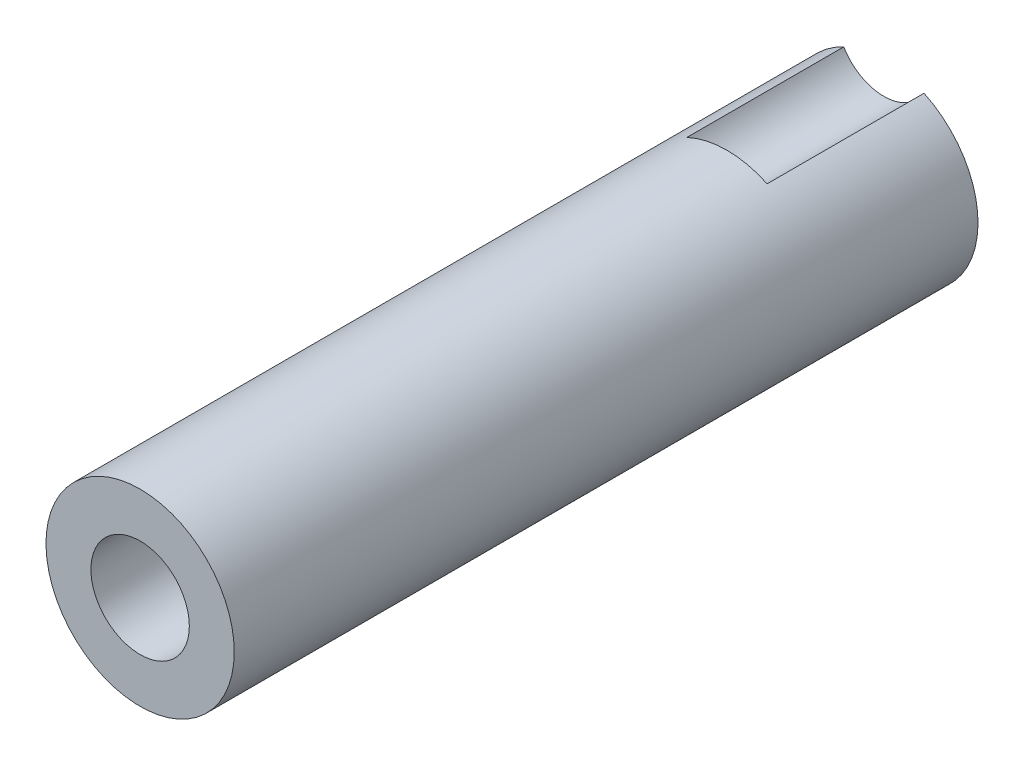
ISO-10303-21;
HEADER;
FILE_DESCRIPTION(('STEP AP214'),'2;1');
FILE_NAME('part.step','',(''),(''),'','','');
FILE_SCHEMA(('AUTOMOTIVE_DESIGN { 1 0 10303 214 1 1 1 1 }'));
ENDSEC;
DATA;
#1=APPLICATION_CONTEXT('core data for automotive mechanical design processes');
#2=APPLICATION_PROTOCOL_DEFINITION('international standard','automotive_design',2000,#1);
#3=PRODUCT_CONTEXT('',#1,'mechanical');
#4=PRODUCT('Part','Part','',(#3));
#5=PRODUCT_RELATED_PRODUCT_CATEGORY('part','',(#4));
#6=PRODUCT_DEFINITION_FORMATION('','',#4);
#7=PRODUCT_DEFINITION_CONTEXT('part definition',#1,'design');
#8=PRODUCT_DEFINITION('design','',#6,#7);
#9=PRODUCT_DEFINITION_SHAPE('','',#8);
#10=(LENGTH_UNIT() NAMED_UNIT(*) SI_UNIT(.MILLI.,.METRE.));
#11=(NAMED_UNIT(*) PLANE_ANGLE_UNIT() SI_UNIT($,.RADIAN.));
#12=(NAMED_UNIT(*) SI_UNIT($,.STERADIAN.) SOLID_ANGLE_UNIT());
#13=UNCERTAINTY_MEASURE_WITH_UNIT(LENGTH_MEASURE(1.E-05),#10,'distance_accuracy_value','');
#14=(GEOMETRIC_REPRESENTATION_CONTEXT(3) GLOBAL_UNCERTAINTY_ASSIGNED_CONTEXT((#13)) GLOBAL_UNIT_ASSIGNED_CONTEXT((#10,
#11,#12)) REPRESENTATION_CONTEXT('',''));
#15=CARTESIAN_POINT('',(0.,0.,0.));
#16=DIRECTION('',(0.,0.,1.));
#17=DIRECTION('',(1.,0.,0.));
#18=AXIS2_PLACEMENT_3D('',#15,#16,#17);
#19=CARTESIAN_POINT('',(0.,0.,50.5714));
#20=DIRECTION('',(0.,0.,-1.));
#21=DIRECTION('',(-1.,0.,0.));
#22=AXIS2_PLACEMENT_3D('',#19,#20,#21);
#23=CYLINDRICAL_SURFACE('',#22,6.4008);
#24=DIRECTION('',(0.,0.,-1.));
#25=VECTOR('',#24,1.);
#26=CARTESIAN_POINT('',(-2.72999636791962,5.78941797343616,5.334));
#27=LINE('',#26,#25);
#28=CARTESIAN_POINT('',(-2.72999636791962,5.78941797343616,10.668));
#29=VERTEX_POINT('',#28);
#30=CARTESIAN_POINT('',(-2.72999636791962,5.78941797343616,0.));
#31=VERTEX_POINT('',#30);
#32=EDGE_CURVE('E44',#29,#31,#27,.T.);
#33=ORIENTED_EDGE('',*,*,#32,.T.);
#34=CARTESIAN_POINT('',(0.,0.,0.));
#35=DIRECTION('',(0.,0.,-1.));
#36=DIRECTION('',(-1.,0.,0.));
#37=AXIS2_PLACEMENT_3D('',#34,#35,#36);
#38=CIRCLE('',#37,6.4008);
#39=CARTESIAN_POINT('',(2.72999636791962,5.78941797343616,0.));
#40=VERTEX_POINT('',#39);
#41=EDGE_CURVE('E65',#40,#31,#38,.T.);
#42=ORIENTED_EDGE('',*,*,#41,.F.);
#43=DIRECTION('',(0.,0.,-1.));
#44=VECTOR('',#43,1.);
#45=CARTESIAN_POINT('',(2.72999636791962,5.78941797343616,5.334));
#46=LINE('',#45,#44);
#47=CARTESIAN_POINT('',(2.72999636791962,5.78941797343616,10.668));
#48=VERTEX_POINT('',#47);
#49=EDGE_CURVE('E11',#40,#48,#46,.F.);
#50=ORIENTED_EDGE('',*,*,#49,.T.);
#51=CARTESIAN_POINT('',(0.,0.,10.668));
#52=DIRECTION('',(0.,0.,-1.));
#53=DIRECTION('',(-1.,0.,0.));
#54=AXIS2_PLACEMENT_3D('',#51,#52,#53);
#55=CIRCLE('',#54,6.4008);
#56=EDGE_CURVE('E67',#29,#48,#55,.T.);
#57=ORIENTED_EDGE('',*,*,#56,.F.);
#58=EDGE_LOOP('',(#33,#42,#50,#57));
#59=FACE_BOUND('',#58,.T.);
#60=CARTESIAN_POINT('',(0.,0.,50.5714));
#61=DIRECTION('',(0.,0.,1.));
#62=DIRECTION('',(1.,0.,0.));
#63=AXIS2_PLACEMENT_3D('',#60,#61,#62);
#64=CIRCLE('',#63,6.4008);
#65=CARTESIAN_POINT('',(6.4008,0.,50.5714));
#66=VERTEX_POINT('',#65);
#67=EDGE_CURVE('E77',#66,#66,#64,.T.);
#68=ORIENTED_EDGE('',*,*,#67,.F.);
#69=EDGE_LOOP('',(#68));
#70=FACE_BOUND('',#69,.T.);
#71=CARTESIAN_POINT('',(0.,-6.4008,41.2212448442553));
#72=CARTESIAN_POINT('',(0.0474340732062871,-6.40079930634947,41.2212468440188));
#73=CARTESIAN_POINT('',(0.0948971894335238,-6.40026716758795,41.2252361426882));
#74=CARTESIAN_POINT('',(0.188501005571676,-6.3981955539805,41.2410863112196));
#75=CARTESIAN_POINT('',(0.234640300491055,-6.39665504742303,41.2529552433061));
#76=CARTESIAN_POINT('',(0.324227949201726,-6.39274012356825,41.2842074051008));
#77=CARTESIAN_POINT('',(0.367678153350597,-6.39036628735958,41.3035853996441));
#78=CARTESIAN_POINT('',(0.450702135257495,-6.38504823673574,41.3492937685099));
#79=CARTESIAN_POINT('',(0.490276540432467,-6.38210411486934,41.3756230150003));
#80=CARTESIAN_POINT('',(0.564677154189151,-6.37595354801717,41.4346597285384));
#81=CARTESIAN_POINT('',(0.599476035370789,-6.37274574864001,41.4674014971847));
#82=CARTESIAN_POINT('',(0.663102309772368,-6.36644019413969,41.5382601211045));
#83=CARTESIAN_POINT('',(0.691929388065011,-6.36334244482722,41.5763772596738));
#84=CARTESIAN_POINT('',(0.742896927731512,-6.35759447160473,41.6570840134187));
#85=CARTESIAN_POINT('',(0.765011536982191,-6.35494599484517,41.6996900897749));
#86=CARTESIAN_POINT('',(0.801761259509498,-6.35041451035176,41.7880524582763));
#87=CARTESIAN_POINT('',(0.816396691146764,-6.34853147003685,41.8338086162402));
#88=CARTESIAN_POINT('',(0.837689020516301,-6.34575712792561,41.9268874849713));
#89=CARTESIAN_POINT('',(0.844392262088291,-6.344860067752,41.9741994196483));
#90=CARTESIAN_POINT('',(0.849773382068461,-6.34414167924528,42.069284522999));
#91=CARTESIAN_POINT('',(0.84845162210079,-6.34432030243953,42.1170576707925));
#92=CARTESIAN_POINT('',(0.837858252693565,-6.34572782901721,42.2113848804296));
#93=CARTESIAN_POINT('',(0.82863785182666,-6.34694996690569,42.2579448085813));
#94=CARTESIAN_POINT('',(0.802588906612774,-6.35029626312564,42.3488507023087));
#95=CARTESIAN_POINT('',(0.785760190653181,-6.35242044180341,42.3931966179203));
#96=CARTESIAN_POINT('',(0.744917786656304,-6.35733909488995,42.4785738233854));
#97=CARTESIAN_POINT('',(0.720882005527347,-6.36013562507613,42.5195944211626));
#98=CARTESIAN_POINT('',(0.666323542776344,-6.36608232560481,42.5970393476973));
#99=CARTESIAN_POINT('',(0.635800527759212,-6.36923251411877,42.6334634400755));
#100=CARTESIAN_POINT('',(0.568851000164402,-6.37556161065031,42.7009785170392));
#101=CARTESIAN_POINT('',(0.532380379457571,-6.37874055133087,42.7320257766306));
#102=CARTESIAN_POINT('',(0.454722339048766,-6.38474607200319,42.7875648776525));
#103=CARTESIAN_POINT('',(0.413534906035277,-6.3875726510005,42.8120567005822));
#104=CARTESIAN_POINT('',(0.327577497680802,-6.39255704175212,42.8537903522786));
#105=CARTESIAN_POINT('',(0.282806089177627,-6.39471458427399,42.8710292633347));
#106=CARTESIAN_POINT('',(0.190969006027932,-6.39811542787225,42.8977320992131));
#107=CARTESIAN_POINT('',(0.143903452390796,-6.39935877711412,42.9071964336521));
#108=CARTESIAN_POINT('',(0.0491919670607504,-6.40078484907394,42.9180243713195));
#109=CARTESIAN_POINT('',(0.00155303170119704,-6.40097545336103,42.9194481732869));
#110=CARTESIAN_POINT('',(-0.0932840530580398,-6.40029588895989,42.9143137556933));
#111=CARTESIAN_POINT('',(-0.140482213015164,-6.39942574574466,42.9077557278097));
#112=CARTESIAN_POINT('',(-0.232919000005544,-6.39672735247378,42.8868938353439));
#113=CARTESIAN_POINT('',(-0.278164258354489,-6.39490267561878,42.872618851799));
#114=CARTESIAN_POINT('',(-0.365618836556745,-6.39049938639299,42.8367584105023));
#115=CARTESIAN_POINT('',(-0.407828041715176,-6.38792074555785,42.8151726767434));
#116=CARTESIAN_POINT('',(-0.488280032492378,-6.38227709781391,42.7651590824835));
#117=CARTESIAN_POINT('',(-0.526498548919107,-6.37920937271143,42.7366924946011));
#118=CARTESIAN_POINT('',(-0.597636933611208,-6.37293875920017,42.6737797935972));
#119=CARTESIAN_POINT('',(-0.630556564131398,-6.36973586473488,42.6393334123243));
#120=CARTESIAN_POINT('',(-0.690377849898572,-6.36353138698975,42.5651729379448));
#121=CARTESIAN_POINT('',(-0.717239470157343,-6.36053122974906,42.5254264138517));
#122=CARTESIAN_POINT('',(-0.763905175494006,-6.35509589206621,42.4419504164359));
#123=CARTESIAN_POINT('',(-0.783709416641933,-6.35266069913059,42.3982210312188));
#124=CARTESIAN_POINT('',(-0.815634156294967,-6.34864091477152,42.3081470205118));
#125=CARTESIAN_POINT('',(-0.827776799069733,-6.3470538739926,42.2618103575849));
#126=CARTESIAN_POINT('',(-0.844104751081409,-6.34490321099098,42.1677331990085));
#127=CARTESIAN_POINT('',(-0.848290480568605,-6.3443395347186,42.1199927776346));
#128=CARTESIAN_POINT('',(-0.848577427942054,-6.34430112787213,42.0248617610487));
#129=CARTESIAN_POINT('',(-0.844741553239907,-6.34481792395808,41.9774713467943));
#130=CARTESIAN_POINT('',(-0.829227843741311,-6.34686395914541,41.8840153636112));
#131=CARTESIAN_POINT('',(-0.817550011502049,-6.34839319791665,41.8379497942505));
#132=CARTESIAN_POINT('',(-0.786704295672854,-6.35228909397663,41.7484620283144));
#133=CARTESIAN_POINT('',(-0.767539834695861,-6.35465536855655,41.7050386343023));
#134=CARTESIAN_POINT('',(-0.722271052021757,-6.3599592966614,41.622013693509));
#135=CARTESIAN_POINT('',(-0.696166600838076,-6.36289696084707,41.582412218056));
#136=CARTESIAN_POINT('',(-0.63752675642268,-6.36904022879477,41.5078341838928));
#137=CARTESIAN_POINT('',(-0.604944544416009,-6.37224767890181,41.4728945872481));
#138=CARTESIAN_POINT('',(-0.53437235421914,-6.37855306314037,41.4089553689937));
#139=CARTESIAN_POINT('',(-0.496381108629182,-6.381650971392,41.3799571434117));
#140=CARTESIAN_POINT('',(-0.415881528007162,-6.38740300532315,41.3286166370384));
#141=CARTESIAN_POINT('',(-0.373354599412894,-6.39005517976007,41.3063033030224));
#142=CARTESIAN_POINT('',(-0.285144624494389,-6.3945973907949,41.2691675242657));
#143=CARTESIAN_POINT('',(-0.239465022474224,-6.39648824416932,41.2543370472595));
#144=CARTESIAN_POINT('',(-0.161297995392255,-6.39884575211064,41.2360858023636));
#145=CARTESIAN_POINT('',(-0.129300755714355,-6.39957497061477,41.2305285827725));
#146=CARTESIAN_POINT('',(-0.064873537128256,-6.40055232969115,41.2231074358494));
#147=CARTESIAN_POINT('',(-0.0324435619770359,-6.4008004744373,41.2212434764736));
#148=CARTESIAN_POINT('',(0.,-6.4008,41.2212448442553));
#149=B_SPLINE_CURVE_WITH_KNOTS('',3,(#71,#72,#73,#74,#75,#76,#77,#78,#79,#80,#81,#82,#83,#84,
#85,#86,#87,#88,#89,#90,#91,#92,#93,#94,#95,#96,#97,#98,#99,#100,#101,#102,#103,#104,#105,#106,
#107,#108,#109,#110,#111,#112,#113,#114,#115,#116,#117,#118,#119,#120,#121,#122,#123,#124,#125,
#126,#127,#128,#129,#130,#131,#132,#133,#134,#135,#136,#137,#138,#139,#140,#141,#142,#143,#144,
#145,#146,#147,#148),.UNSPECIFIED.,.T.,.F.,(4,2,2,2,2,2,2,2,2,2,2,2,2,2,2,2,2,2,2,2,2,2,2,2,2,2,
2,2,2,2,2,2,2,2,2,2,2,2,4),(0.,0.142183700813307,0.28451310475484,0.426743457554824,
0.568950747819922,0.711940594986421,0.854937980906306,0.998479310093306,1.14201452875337,
1.28470693574884,1.42739291275957,1.56916076714991,1.71093181940542,1.85314198955315,
1.99535947000326,2.13868409481551,2.28200912412023,2.42539175539767,2.56876683183152,
2.7110670343244,2.85336381965949,2.99513170325348,3.13690493969165,3.27949549727675,
3.42209245069204,3.56560582318928,3.7091160217707,3.85220951045053,3.99529544133144,
4.13726346624707,4.27923144486833,4.42113459673033,4.56304039641192,4.70601178396103,
4.84901672667735,4.99263224186223,5.13609326722722,5.23334373342689,5.33059335585336),.UNSPECIFIED.);
#150=CARTESIAN_POINT('',(0.,-6.4008,41.2212448442553));
#151=VERTEX_POINT('',#150);
#152=EDGE_CURVE('E72',#151,#151,#149,.T.);
#153=ORIENTED_EDGE('',*,*,#152,.F.);
#154=EDGE_LOOP('',(#153));
#155=FACE_BOUND('',#154,.T.);
#156=ADVANCED_FACE('F31',(#59,#70,#155),#23,.T.);
#157=CARTESIAN_POINT('',(0.,0.,0.));
#158=DIRECTION('',(0.,0.,1.));
#159=DIRECTION('',(1.,0.,0.));
#160=AXIS2_PLACEMENT_3D('',#157,#158,#159);
#161=CYLINDRICAL_SURFACE('',#160,3.34645);
#162=CARTESIAN_POINT('',(0.,0.,50.5714));
#163=DIRECTION('',(0.,0.,1.));
#164=DIRECTION('',(1.,0.,0.));
#165=AXIS2_PLACEMENT_3D('',#162,#163,#164);
#166=CIRCLE('',#165,3.34645);
#167=CARTESIAN_POINT('',(3.34645,0.,50.5714));
#168=VERTEX_POINT('',#167);
#169=EDGE_CURVE('E71',#168,#168,#166,.T.);
#170=ORIENTED_EDGE('',*,*,#169,.T.);
#171=EDGE_LOOP('',(#170));
#172=FACE_BOUND('',#171,.T.);
#173=CARTESIAN_POINT('',(0.,0.,0.));
#174=DIRECTION('',(0.,0.,1.));
#175=DIRECTION('',(1.,0.,0.));
#176=AXIS2_PLACEMENT_3D('',#173,#174,#175);
#177=CIRCLE('',#176,3.34645);
#178=CARTESIAN_POINT('',(3.34645,0.,0.));
#179=VERTEX_POINT('',#178);
#180=EDGE_CURVE('E75',#179,#179,#177,.T.);
#181=ORIENTED_EDGE('',*,*,#180,.F.);
#182=EDGE_LOOP('',(#181));
#183=FACE_BOUND('',#182,.T.);
#184=CARTESIAN_POINT('',(0.,-3.34645,41.2212448442553));
#185=CARTESIAN_POINT('',(-0.046855140178312,-3.34644922286622,41.2212461194521));
#186=CARTESIAN_POINT('',(-0.093724399007182,-3.34545616094811,41.2251392661404));
#187=CARTESIAN_POINT('',(-0.186118210969051,-3.34159090993116,41.2405847911095));
#188=CARTESIAN_POINT('',(-0.231642011504148,-3.33871768918406,41.2521413743853));
#189=CARTESIAN_POINT('',(-0.319997436379721,-3.33141007042915,41.2825180422032));
#190=CARTESIAN_POINT('',(-0.362832269593677,-3.32697757658087,41.3013292701743));
#191=CARTESIAN_POINT('',(-0.444738445297316,-3.31702272073634,41.3456497379346));
#192=CARTESIAN_POINT('',(-0.483809634666103,-3.3115003144257,41.3711592500811));
#193=CARTESIAN_POINT('',(-0.557905218435083,-3.29983397893042,41.4287216012223));
#194=CARTESIAN_POINT('',(-0.592838736004443,-3.29368024310911,41.4608894365933));
#195=CARTESIAN_POINT('',(-0.656877295767481,-3.28150950708209,41.5306091797307));
#196=CARTESIAN_POINT('',(-0.685981661444368,-3.27549252281917,41.5681617115647));
#197=CARTESIAN_POINT('',(-0.737966393464801,-3.26417739115545,41.6482945799173));
#198=CARTESIAN_POINT('',(-0.760744504393251,-3.25889167778696,41.6909431684398));
#199=CARTESIAN_POINT('',(-0.798772336345714,-3.24978081638102,41.779619924957));
#200=CARTESIAN_POINT('',(-0.814023298734401,-3.24595542753289,41.8256475342501));
#201=CARTESIAN_POINT('',(-0.83625273417204,-3.24029922579774,41.918774990127));
#202=CARTESIAN_POINT('',(-0.843394892088798,-3.23842900963119,41.9658333159041));
#203=CARTESIAN_POINT('',(-0.849713928911291,-3.23677700577472,42.0605145242131));
#204=CARTESIAN_POINT('',(-0.848892143043855,-3.23699486799962,42.1081373107709));
#205=CARTESIAN_POINT('',(-0.839437082330112,-3.23945901745229,42.2013363588562));
#206=CARTESIAN_POINT('',(-0.830999474735796,-3.24165449258413,42.2469340249466));
#207=CARTESIAN_POINT('',(-0.806864675010443,-3.24774543662603,42.3360445217381));
#208=CARTESIAN_POINT('',(-0.791166952603702,-3.2516410297108,42.3795571998964));
#209=CARTESIAN_POINT('',(-0.752792299825667,-3.26073950548053,42.4637841905082));
#210=CARTESIAN_POINT('',(-0.730044859343248,-3.26595549335984,42.5044649026533));
#211=CARTESIAN_POINT('',(-0.678265773527575,-3.27709972353753,42.5815016785993));
#212=CARTESIAN_POINT('',(-0.649232999812558,-3.28302809364202,42.6178569640546));
#213=CARTESIAN_POINT('',(-0.584696552408856,-3.29514255119403,42.6863315010893));
#214=CARTESIAN_POINT('',(-0.54902792488096,-3.30133109501045,42.7182950511326));
#215=CARTESIAN_POINT('',(-0.472762221074582,-3.31311183753241,42.7758169578319));
#216=CARTESIAN_POINT('',(-0.43216498575662,-3.31870401698313,42.8013751077129));
#217=CARTESIAN_POINT('',(-0.346968395913905,-3.32869108110796,42.8454202213386));
#218=CARTESIAN_POINT('',(-0.30235510889328,-3.33308156602722,42.8638812978069));
#219=CARTESIAN_POINT('',(-0.210522075982982,-3.34013860154043,42.8929979391403));
#220=CARTESIAN_POINT('',(-0.163302845266299,-3.34280549155885,42.9036550408833));
#221=CARTESIAN_POINT('',(-0.0689290216319944,-3.34606439339235,42.9166220470951));
#222=CARTESIAN_POINT('',(-0.02180532815624,-3.34670908051097,42.9191439128834));
#223=CARTESIAN_POINT('',(0.0721909477636844,-3.34600125980954,42.9163510431005));
#224=CARTESIAN_POINT('',(0.119063553094932,-3.34464893723953,42.9110370344143));
#225=CARTESIAN_POINT('',(0.210486423087164,-3.34013285871479,42.8928978066744));
#226=CARTESIAN_POINT('',(0.255061247782589,-3.33699713557128,42.8801887585429));
#227=CARTESIAN_POINT('',(0.341443530735716,-3.32926812016875,42.8477533656609));
#228=CARTESIAN_POINT('',(0.383250704471527,-3.32467467833273,42.8280263007641));
#229=CARTESIAN_POINT('',(0.463750181023245,-3.31441415244791,42.7817077323467));
#230=CARTESIAN_POINT('',(0.502372235126592,-3.30872910641467,42.7549982153505));
#231=CARTESIAN_POINT('',(0.574661149019078,-3.29694341806126,42.6956232530182));
#232=CARTESIAN_POINT('',(0.608327126069487,-3.2908427019875,42.6629567489828));
#233=CARTESIAN_POINT('',(0.670625831872034,-3.27872276860301,42.5916098382007));
#234=CARTESIAN_POINT('',(0.699109684509111,-3.27270951738882,42.5527981984895));
#235=CARTESIAN_POINT('',(0.749160666414549,-3.26161702799358,42.4708214052015));
#236=CARTESIAN_POINT('',(0.770728100355146,-3.25653774867474,42.4276564435011));
#237=CARTESIAN_POINT('',(0.806172696049506,-3.24794488051828,42.3384273485395));
#238=CARTESIAN_POINT('',(0.820095348753568,-3.24442205493094,42.2923822220817));
#239=CARTESIAN_POINT('',(0.839972822001041,-3.23933334511949,42.1985014218372));
#240=CARTESIAN_POINT('',(0.845929444615408,-3.23776701830259,42.150666155533));
#241=CARTESIAN_POINT('',(0.849609605091806,-3.23680306605743,42.0560797701825));
#242=CARTESIAN_POINT('',(0.847571357599347,-3.23734268941751,42.0093384128522));
#243=CARTESIAN_POINT('',(0.8358663582754,-3.24038437141631,41.9168892417301));
#244=CARTESIAN_POINT('',(0.826199768291855,-3.24288638841958,41.8711814060317));
#245=CARTESIAN_POINT('',(0.799644286447847,-3.24953546732331,41.7823642062023));
#246=CARTESIAN_POINT('',(0.782801276159386,-3.25367206672868,41.7392402865596));
#247=CARTESIAN_POINT('',(0.74240718898018,-3.26312542508943,41.6563991659119));
#248=CARTESIAN_POINT('',(0.71885515566847,-3.26844235228543,41.6166824516804));
#249=CARTESIAN_POINT('',(0.664969921384663,-3.27983520623318,41.5406349225613));
#250=CARTESIAN_POINT('',(0.634471991373064,-3.28592764759146,41.5044232857508));
#251=CARTESIAN_POINT('',(0.567880105468842,-3.29808783266113,41.4375542713679));
#252=CARTESIAN_POINT('',(0.531784816653216,-3.30415557013556,41.4068982205518));
#253=CARTESIAN_POINT('',(0.454204989039906,-3.31571867137369,41.351448455251));
#254=CARTESIAN_POINT('',(0.41263199849008,-3.32120115148785,41.3267755988393));
#255=CARTESIAN_POINT('',(0.32579255474546,-3.33083910690769,41.2848081700612));
#256=CARTESIAN_POINT('',(0.280528718278637,-3.33499551227502,41.2675084235849));
#257=CARTESIAN_POINT('',(0.196135895733872,-3.34091434154162,41.2432822450314));
#258=CARTESIAN_POINT('',(0.157401351062158,-3.34297577702509,41.2350363528519));
#259=CARTESIAN_POINT('',(0.0791145158417582,-3.34574388033687,41.2240173322667));
#260=CARTESIAN_POINT('',(0.0395622907428861,-3.34645065617545,41.2212437675387));
#261=CARTESIAN_POINT('',(0.,-3.34645,41.2212448442553));
#262=B_SPLINE_CURVE_WITH_KNOTS('',3,(#184,#185,#186,#187,#188,#189,#190,#191,#192,#193,#194,
#195,#196,#197,#198,#199,#200,#201,#202,#203,#204,#205,#206,#207,#208,#209,#210,#211,#212,#213,
#214,#215,#216,#217,#218,#219,#220,#221,#222,#223,#224,#225,#226,#227,#228,#229,#230,#231,#232,
#233,#234,#235,#236,#237,#238,#239,#240,#241,#242,#243,#244,#245,#246,#247,#248,#249,#250,#251,
#252,#253,#254,#255,#256,#257,#258,#259,#260,#261),.UNSPECIFIED.,.T.,.F.,(4,2,2,2,2,2,2,2,2,2,2,
2,2,2,2,2,2,2,2,2,2,2,2,2,2,2,2,2,2,2,2,2,2,2,2,2,2,2,4),(0.,0.140420417968074,
0.280917949680159,0.421244500258459,0.561576757503266,0.704572359629264,0.847584547862895,
0.992789147514879,1.13796979226015,1.28016458721425,1.42233554234413,1.56095464222296,
1.69958386838134,1.83964700888508,1.9797353152696,2.12393645989092,2.26814225892479,
2.41286918184217,2.55756759525463,2.69846413005567,2.83934759559037,2.97807544409365,
3.11681753211323,3.25807603920774,3.39935967583062,3.54421748809176,3.68906891840584,
3.83304878904482,3.97699608312373,4.11668739070844,4.25637573458998,4.39518409129709,
4.53401224607586,4.6765587254853,4.81913920237368,4.96439635186746,5.10955139805205,
5.22812529146314,5.34668973030056),.UNSPECIFIED.);
#263=CARTESIAN_POINT('',(0.,-3.34645,41.2212448442553));
#264=VERTEX_POINT('',#263);
#265=EDGE_CURVE('E35',#264,#264,#262,.T.);
#266=ORIENTED_EDGE('',*,*,#265,.F.);
#267=EDGE_LOOP('',(#266));
#268=FACE_BOUND('',#267,.T.);
#269=ADVANCED_FACE('F99',(#172,#183,#268),#161,.F.);
#270=CARTESIAN_POINT('',(0.,0.,0.));
#271=DIRECTION('',(0.,0.,1.));
#272=DIRECTION('',(1.,0.,0.));
#273=AXIS2_PLACEMENT_3D('',#270,#271,#272);
#274=PLANE('',#273);
#275=ORIENTED_EDGE('',*,*,#180,.T.);
#276=EDGE_LOOP('',(#275));
#277=FACE_BOUND('',#276,.T.);
#278=ORIENTED_EDGE('',*,*,#41,.T.);
#279=CARTESIAN_POINT('',(0.,7.41045,0.));
#280=DIRECTION('',(0.,0.,-1.));
#281=DIRECTION('',(-1.,0.,0.));
#282=AXIS2_PLACEMENT_3D('',#279,#280,#281);
#283=CIRCLE('',#282,3.175);
#284=EDGE_CURVE('E70',#40,#31,#283,.T.);
#285=ORIENTED_EDGE('',*,*,#284,.F.);
#286=EDGE_LOOP('',(#278,#285));
#287=FACE_BOUND('',#286,.T.);
#288=ADVANCED_FACE('F33',(#277,#287),#274,.F.);
#289=CARTESIAN_POINT('',(0.,7.41045,10.668));
#290=DIRECTION('',(0.,0.,-1.));
#291=DIRECTION('',(-1.,0.,0.));
#292=AXIS2_PLACEMENT_3D('',#289,#290,#291);
#293=CYLINDRICAL_SURFACE('',#292,3.175);
#294=ORIENTED_EDGE('',*,*,#284,.T.);
#295=ORIENTED_EDGE('',*,*,#32,.F.);
#296=CARTESIAN_POINT('',(0.,7.41045,10.668));
#297=DIRECTION('',(0.,0.,-1.));
#298=DIRECTION('',(-1.,0.,0.));
#299=AXIS2_PLACEMENT_3D('',#296,#297,#298);
#300=CIRCLE('',#299,3.175);
#301=EDGE_CURVE('E55',#48,#29,#300,.T.);
#302=ORIENTED_EDGE('',*,*,#301,.F.);
#303=ORIENTED_EDGE('',*,*,#49,.F.);
#304=EDGE_LOOP('',(#294,#295,#302,#303));
#305=FACE_BOUND('',#304,.T.);
#306=ADVANCED_FACE('F74',(#305),#293,.F.);
#307=CARTESIAN_POINT('',(0.,0.,50.5714));
#308=DIRECTION('',(0.,0.,1.));
#309=DIRECTION('',(1.,0.,0.));
#310=AXIS2_PLACEMENT_3D('',#307,#308,#309);
#311=PLANE('',#310);
#312=ORIENTED_EDGE('',*,*,#169,.F.);
#313=EDGE_LOOP('',(#312));
#314=FACE_BOUND('',#313,.T.);
#315=ORIENTED_EDGE('',*,*,#67,.T.);
#316=EDGE_LOOP('',(#315));
#317=FACE_BOUND('',#316,.T.);
#318=ADVANCED_FACE('F88',(#314,#317),#311,.T.);
#319=CARTESIAN_POINT('',(0.,7.41045,10.668));
#320=DIRECTION('',(0.,0.,-1.));
#321=DIRECTION('',(-1.,0.,0.));
#322=AXIS2_PLACEMENT_3D('',#319,#320,#321);
#323=PLANE('',#322);
#324=ORIENTED_EDGE('',*,*,#56,.T.);
#325=ORIENTED_EDGE('',*,*,#301,.T.);
#326=EDGE_LOOP('',(#324,#325));
#327=FACE_BOUND('',#326,.T.);
#328=ADVANCED_FACE('F85',(#327),#323,.T.);
#329=CARTESIAN_POINT('',(0.,-1.3208,42.0696832158427));
#330=DIRECTION('',(0.,-1.,0.));
#331=DIRECTION('',(0.,0.,-1.));
#332=AXIS2_PLACEMENT_3D('',#329,#330,#331);
#333=CYLINDRICAL_SURFACE('',#332,0.848438371587434);
#334=ORIENTED_EDGE('',*,*,#265,.T.);
#335=EDGE_LOOP('',(#334));
#336=FACE_BOUND('',#335,.T.);
#337=ORIENTED_EDGE('',*,*,#152,.T.);
#338=EDGE_LOOP('',(#337));
#339=FACE_BOUND('',#338,.T.);
#340=ADVANCED_FACE('F87',(#336,#339),#333,.F.);
#341=CLOSED_SHELL('',(#156,#269,#288,#306,#318,#328,#340));
#342=MANIFOLD_SOLID_BREP('B2',#341);
#343=ADVANCED_BREP_SHAPE_REPRESENTATION('',(#18,#342),#14);
#344=SHAPE_DEFINITION_REPRESENTATION(#9,#343);
ENDSEC;
END-ISO-10303-21;
